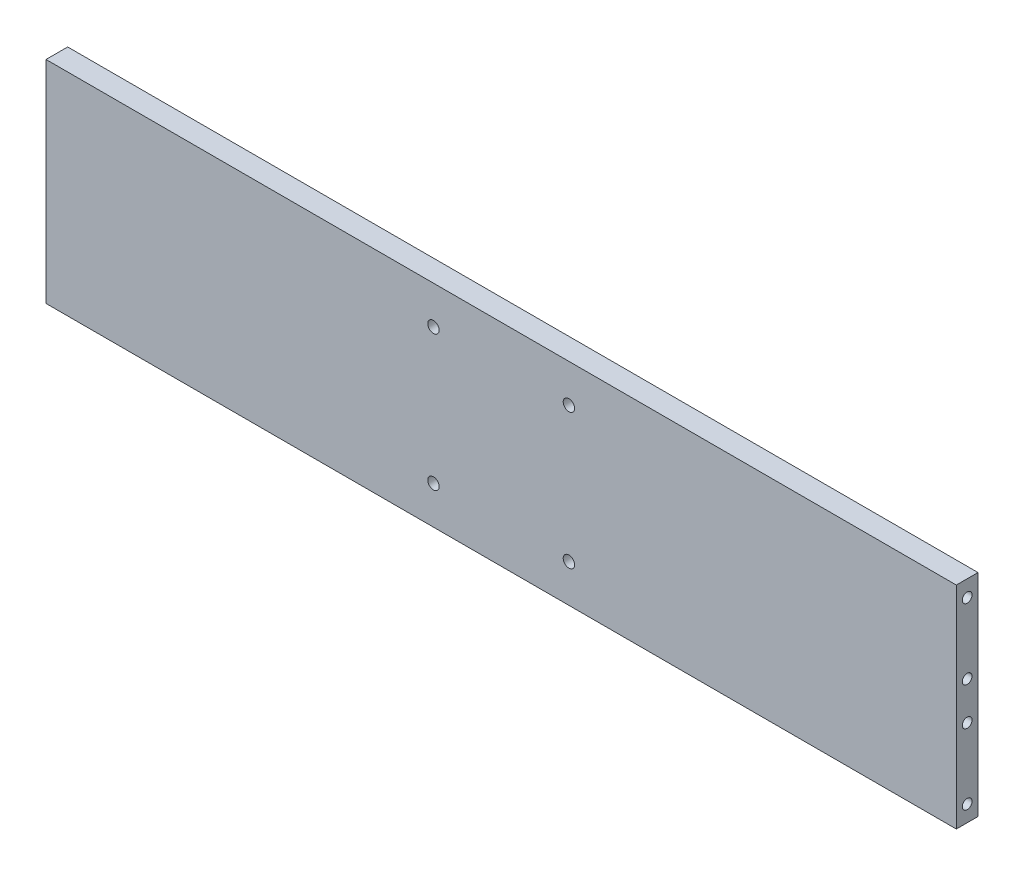
ISO-10303-21;
HEADER;
FILE_DESCRIPTION(('STEP AP214'),'2;1');
FILE_NAME('part.step','',(''),(''),'','','');
FILE_SCHEMA(('AUTOMOTIVE_DESIGN { 1 0 10303 214 1 1 1 1 }'));
ENDSEC;
DATA;
#1=APPLICATION_CONTEXT('core data for automotive mechanical design processes');
#2=APPLICATION_PROTOCOL_DEFINITION('international standard','automotive_design',2000,#1);
#3=PRODUCT_CONTEXT('',#1,'mechanical');
#4=PRODUCT('Part','Part','',(#3));
#5=PRODUCT_RELATED_PRODUCT_CATEGORY('part','',(#4));
#6=PRODUCT_DEFINITION_FORMATION('','',#4);
#7=PRODUCT_DEFINITION_CONTEXT('part definition',#1,'design');
#8=PRODUCT_DEFINITION('design','',#6,#7);
#9=PRODUCT_DEFINITION_SHAPE('','',#8);
#10=(LENGTH_UNIT() NAMED_UNIT(*) SI_UNIT(.MILLI.,.METRE.));
#11=(NAMED_UNIT(*) PLANE_ANGLE_UNIT() SI_UNIT($,.RADIAN.));
#12=(NAMED_UNIT(*) SI_UNIT($,.STERADIAN.) SOLID_ANGLE_UNIT());
#13=UNCERTAINTY_MEASURE_WITH_UNIT(LENGTH_MEASURE(1.E-05),#10,'distance_accuracy_value','');
#14=(GEOMETRIC_REPRESENTATION_CONTEXT(3) GLOBAL_UNCERTAINTY_ASSIGNED_CONTEXT((#13)) GLOBAL_UNIT_ASSIGNED_CONTEXT((#10,
#11,#12)) REPRESENTATION_CONTEXT('',''));
#15=CARTESIAN_POINT('',(0.,0.,0.));
#16=DIRECTION('',(0.,0.,1.));
#17=DIRECTION('',(1.,0.,0.));
#18=AXIS2_PLACEMENT_3D('',#15,#16,#17);
#19=CARTESIAN_POINT('',(0.,0.,8.));
#20=DIRECTION('',(0.,0.,-1.));
#21=DIRECTION('',(-1.,0.,0.));
#22=AXIS2_PLACEMENT_3D('',#19,#20,#21);
#23=PLANE('',#22);
#24=CARTESIAN_POINT('',(25.,-25.,8.));
#25=DIRECTION('',(0.,0.,1.));
#26=DIRECTION('',(1.,0.,0.));
#27=AXIS2_PLACEMENT_3D('',#24,#25,#26);
#28=CIRCLE('',#27,2.1);
#29=CARTESIAN_POINT('',(27.1,-25.,8.));
#30=VERTEX_POINT('',#29);
#31=EDGE_CURVE('E121',#30,#30,#28,.T.);
#32=ORIENTED_EDGE('',*,*,#31,.F.);
#33=EDGE_LOOP('',(#32));
#34=FACE_BOUND('',#33,.T.);
#35=CARTESIAN_POINT('',(-25.,25.,8.));
#36=DIRECTION('',(0.,0.,1.));
#37=DIRECTION('',(1.,0.,0.));
#38=AXIS2_PLACEMENT_3D('',#35,#36,#37);
#39=CIRCLE('',#38,2.1);
#40=CARTESIAN_POINT('',(-22.9,25.,8.));
#41=VERTEX_POINT('',#40);
#42=EDGE_CURVE('E100',#41,#41,#39,.T.);
#43=ORIENTED_EDGE('',*,*,#42,.F.);
#44=EDGE_LOOP('',(#43));
#45=FACE_BOUND('',#44,.T.);
#46=DIRECTION('',(0.,1.,0.));
#47=VECTOR('',#46,1.);
#48=CARTESIAN_POINT('',(168.,-39.,8.));
#49=LINE('',#48,#47);
#50=CARTESIAN_POINT('',(168.,-39.,8.));
#51=VERTEX_POINT('',#50);
#52=CARTESIAN_POINT('',(168.,39.,8.));
#53=VERTEX_POINT('',#52);
#54=EDGE_CURVE('E85',#51,#53,#49,.T.);
#55=ORIENTED_EDGE('',*,*,#54,.T.);
#56=DIRECTION('',(-1.,0.,0.));
#57=VECTOR('',#56,1.);
#58=CARTESIAN_POINT('',(-168.,39.,8.));
#59=LINE('',#58,#57);
#60=CARTESIAN_POINT('',(-168.,39.,8.));
#61=VERTEX_POINT('',#60);
#62=EDGE_CURVE('E80',#53,#61,#59,.T.);
#63=ORIENTED_EDGE('',*,*,#62,.T.);
#64=DIRECTION('',(0.,-1.,0.));
#65=VECTOR('',#64,1.);
#66=CARTESIAN_POINT('',(-168.,-39.,8.));
#67=LINE('',#66,#65);
#68=CARTESIAN_POINT('',(-168.,-39.,8.));
#69=VERTEX_POINT('',#68);
#70=EDGE_CURVE('E83',#61,#69,#67,.T.);
#71=ORIENTED_EDGE('',*,*,#70,.T.);
#72=DIRECTION('',(1.,0.,0.));
#73=VECTOR('',#72,1.);
#74=CARTESIAN_POINT('',(-168.,-39.,8.));
#75=LINE('',#74,#73);
#76=EDGE_CURVE('E50',#69,#51,#75,.T.);
#77=ORIENTED_EDGE('',*,*,#76,.T.);
#78=EDGE_LOOP('',(#55,#63,#71,#77));
#79=FACE_BOUND('',#78,.T.);
#80=CARTESIAN_POINT('',(25.,25.,8.));
#81=DIRECTION('',(0.,0.,1.));
#82=DIRECTION('',(1.,0.,0.));
#83=AXIS2_PLACEMENT_3D('',#80,#81,#82);
#84=CIRCLE('',#83,2.1);
#85=CARTESIAN_POINT('',(27.1,25.,8.));
#86=VERTEX_POINT('',#85);
#87=EDGE_CURVE('E115',#86,#86,#84,.T.);
#88=ORIENTED_EDGE('',*,*,#87,.F.);
#89=EDGE_LOOP('',(#88));
#90=FACE_BOUND('',#89,.T.);
#91=CARTESIAN_POINT('',(-25.,-25.,8.));
#92=DIRECTION('',(0.,0.,1.));
#93=DIRECTION('',(1.,0.,0.));
#94=AXIS2_PLACEMENT_3D('',#91,#92,#93);
#95=CIRCLE('',#94,2.1);
#96=CARTESIAN_POINT('',(-22.9,-25.,8.));
#97=VERTEX_POINT('',#96);
#98=EDGE_CURVE('E127',#97,#97,#95,.T.);
#99=ORIENTED_EDGE('',*,*,#98,.F.);
#100=EDGE_LOOP('',(#99));
#101=FACE_BOUND('',#100,.T.);
#102=ADVANCED_FACE('F33',(#34,#45,#79,#90,#101),#23,.F.);
#103=CARTESIAN_POINT('',(0.,0.,0.));
#104=DIRECTION('',(0.,0.,-1.));
#105=DIRECTION('',(-1.,0.,0.));
#106=AXIS2_PLACEMENT_3D('',#103,#104,#105);
#107=PLANE('',#106);
#108=CARTESIAN_POINT('',(25.,-25.,0.));
#109=DIRECTION('',(0.,0.,1.));
#110=DIRECTION('',(1.,0.,0.));
#111=AXIS2_PLACEMENT_3D('',#108,#109,#110);
#112=CIRCLE('',#111,2.1);
#113=CARTESIAN_POINT('',(27.1,-25.,0.));
#114=VERTEX_POINT('',#113);
#115=EDGE_CURVE('E124',#114,#114,#112,.T.);
#116=ORIENTED_EDGE('',*,*,#115,.T.);
#117=EDGE_LOOP('',(#116));
#118=FACE_BOUND('',#117,.T.);
#119=CARTESIAN_POINT('',(-25.,25.,0.));
#120=DIRECTION('',(0.,0.,1.));
#121=DIRECTION('',(1.,0.,0.));
#122=AXIS2_PLACEMENT_3D('',#119,#120,#121);
#123=CIRCLE('',#122,2.1);
#124=CARTESIAN_POINT('',(-22.9,25.,0.));
#125=VERTEX_POINT('',#124);
#126=EDGE_CURVE('E112',#125,#125,#123,.T.);
#127=ORIENTED_EDGE('',*,*,#126,.T.);
#128=EDGE_LOOP('',(#127));
#129=FACE_BOUND('',#128,.T.);
#130=DIRECTION('',(0.,1.,0.));
#131=VECTOR('',#130,1.);
#132=CARTESIAN_POINT('',(168.,-39.,0.));
#133=LINE('',#132,#131);
#134=CARTESIAN_POINT('',(168.,-39.,0.));
#135=VERTEX_POINT('',#134);
#136=CARTESIAN_POINT('',(168.,39.,0.));
#137=VERTEX_POINT('',#136);
#138=EDGE_CURVE('E97',#135,#137,#133,.T.);
#139=ORIENTED_EDGE('',*,*,#138,.F.);
#140=DIRECTION('',(1.,0.,0.));
#141=VECTOR('',#140,1.);
#142=CARTESIAN_POINT('',(-168.,-39.,0.));
#143=LINE('',#142,#141);
#144=CARTESIAN_POINT('',(-168.,-39.,0.));
#145=VERTEX_POINT('',#144);
#146=EDGE_CURVE('E73',#145,#135,#143,.T.);
#147=ORIENTED_EDGE('',*,*,#146,.F.);
#148=DIRECTION('',(0.,-1.,0.));
#149=VECTOR('',#148,1.);
#150=CARTESIAN_POINT('',(-168.,-39.,0.));
#151=LINE('',#150,#149);
#152=CARTESIAN_POINT('',(-168.,39.,0.));
#153=VERTEX_POINT('',#152);
#154=EDGE_CURVE('E67',#153,#145,#151,.T.);
#155=ORIENTED_EDGE('',*,*,#154,.F.);
#156=DIRECTION('',(-1.,0.,0.));
#157=VECTOR('',#156,1.);
#158=CARTESIAN_POINT('',(-168.,39.,0.));
#159=LINE('',#158,#157);
#160=EDGE_CURVE('E89',#137,#153,#159,.T.);
#161=ORIENTED_EDGE('',*,*,#160,.F.);
#162=EDGE_LOOP('',(#139,#147,#155,#161));
#163=FACE_BOUND('',#162,.T.);
#164=CARTESIAN_POINT('',(25.,25.,0.));
#165=DIRECTION('',(0.,0.,1.));
#166=DIRECTION('',(1.,0.,0.));
#167=AXIS2_PLACEMENT_3D('',#164,#165,#166);
#168=CIRCLE('',#167,2.1);
#169=CARTESIAN_POINT('',(27.1,25.,0.));
#170=VERTEX_POINT('',#169);
#171=EDGE_CURVE('E118',#170,#170,#168,.T.);
#172=ORIENTED_EDGE('',*,*,#171,.T.);
#173=EDGE_LOOP('',(#172));
#174=FACE_BOUND('',#173,.T.);
#175=CARTESIAN_POINT('',(-25.,-25.,0.));
#176=DIRECTION('',(0.,0.,1.));
#177=DIRECTION('',(1.,0.,0.));
#178=AXIS2_PLACEMENT_3D('',#175,#176,#177);
#179=CIRCLE('',#178,2.1);
#180=CARTESIAN_POINT('',(-22.9,-25.,0.));
#181=VERTEX_POINT('',#180);
#182=EDGE_CURVE('E130',#181,#181,#179,.T.);
#183=ORIENTED_EDGE('',*,*,#182,.T.);
#184=EDGE_LOOP('',(#183));
#185=FACE_BOUND('',#184,.T.);
#186=ADVANCED_FACE('F108',(#118,#129,#163,#174,#185),#107,.T.);
#187=CARTESIAN_POINT('',(168.,-39.,8.));
#188=DIRECTION('',(-1.,0.,0.));
#189=DIRECTION('',(0.,0.,1.));
#190=AXIS2_PLACEMENT_3D('',#187,#188,#189);
#191=PLANE('',#190);
#192=CARTESIAN_POINT('',(168.,-33.,4.));
#193=DIRECTION('',(1.,0.,0.));
#194=DIRECTION('',(0.,0.,1.));
#195=AXIS2_PLACEMENT_3D('',#192,#193,#194);
#196=CIRCLE('',#195,1.8);
#197=CARTESIAN_POINT('',(168.,-33.,5.80000000000001));
#198=VERTEX_POINT('',#197);
#199=EDGE_CURVE('E156',#198,#198,#196,.T.);
#200=ORIENTED_EDGE('',*,*,#199,.F.);
#201=EDGE_LOOP('',(#200));
#202=FACE_BOUND('',#201,.T.);
#203=CARTESIAN_POINT('',(168.,-7.,3.99999999999999));
#204=DIRECTION('',(1.,0.,0.));
#205=DIRECTION('',(0.,0.,1.));
#206=AXIS2_PLACEMENT_3D('',#203,#204,#205);
#207=CIRCLE('',#206,1.8);
#208=CARTESIAN_POINT('',(168.,-7.,5.79999999999999));
#209=VERTEX_POINT('',#208);
#210=EDGE_CURVE('E150',#209,#209,#207,.T.);
#211=ORIENTED_EDGE('',*,*,#210,.F.);
#212=EDGE_LOOP('',(#211));
#213=FACE_BOUND('',#212,.T.);
#214=CARTESIAN_POINT('',(168.,7.,3.99999999999999));
#215=DIRECTION('',(1.,0.,0.));
#216=DIRECTION('',(0.,0.,-1.));
#217=AXIS2_PLACEMENT_3D('',#214,#215,#216);
#218=CIRCLE('',#217,1.8);
#219=CARTESIAN_POINT('',(168.,7.,2.2));
#220=VERTEX_POINT('',#219);
#221=EDGE_CURVE('E144',#220,#220,#218,.T.);
#222=ORIENTED_EDGE('',*,*,#221,.F.);
#223=EDGE_LOOP('',(#222));
#224=FACE_BOUND('',#223,.T.);
#225=CARTESIAN_POINT('',(168.,33.,4.));
#226=DIRECTION('',(1.,0.,0.));
#227=DIRECTION('',(0.,0.,-1.));
#228=AXIS2_PLACEMENT_3D('',#225,#226,#227);
#229=CIRCLE('',#228,1.8);
#230=CARTESIAN_POINT('',(168.,33.,2.2));
#231=VERTEX_POINT('',#230);
#232=EDGE_CURVE('E138',#231,#231,#229,.T.);
#233=ORIENTED_EDGE('',*,*,#232,.F.);
#234=EDGE_LOOP('',(#233));
#235=FACE_BOUND('',#234,.T.);
#236=ORIENTED_EDGE('',*,*,#138,.T.);
#237=DIRECTION('',(0.,0.,-1.));
#238=VECTOR('',#237,1.);
#239=CARTESIAN_POINT('',(168.,39.,8.));
#240=LINE('',#239,#238);
#241=EDGE_CURVE('E11',#53,#137,#240,.T.);
#242=ORIENTED_EDGE('',*,*,#241,.F.);
#243=ORIENTED_EDGE('',*,*,#54,.F.);
#244=DIRECTION('',(0.,0.,-1.));
#245=VECTOR('',#244,1.);
#246=CARTESIAN_POINT('',(168.,-39.,8.));
#247=LINE('',#246,#245);
#248=EDGE_CURVE('E93',#51,#135,#247,.T.);
#249=ORIENTED_EDGE('',*,*,#248,.T.);
#250=EDGE_LOOP('',(#236,#242,#243,#249));
#251=FACE_BOUND('',#250,.T.);
#252=ADVANCED_FACE('F35',(#202,#213,#224,#235,#251),#191,.F.);
#253=CARTESIAN_POINT('',(-168.,39.,8.));
#254=DIRECTION('',(0.,-1.,0.));
#255=DIRECTION('',(0.,0.,-1.));
#256=AXIS2_PLACEMENT_3D('',#253,#254,#255);
#257=PLANE('',#256);
#258=ORIENTED_EDGE('',*,*,#160,.T.);
#259=DIRECTION('',(0.,0.,-1.));
#260=VECTOR('',#259,1.);
#261=CARTESIAN_POINT('',(-168.,39.,8.));
#262=LINE('',#261,#260);
#263=EDGE_CURVE('E42',#61,#153,#262,.T.);
#264=ORIENTED_EDGE('',*,*,#263,.F.);
#265=ORIENTED_EDGE('',*,*,#62,.F.);
#266=ORIENTED_EDGE('',*,*,#241,.T.);
#267=EDGE_LOOP('',(#258,#264,#265,#266));
#268=FACE_BOUND('',#267,.T.);
#269=ADVANCED_FACE('F88',(#268),#257,.F.);
#270=CARTESIAN_POINT('',(-168.,-39.,8.));
#271=DIRECTION('',(1.,0.,0.));
#272=DIRECTION('',(0.,0.,-1.));
#273=AXIS2_PLACEMENT_3D('',#270,#271,#272);
#274=PLANE('',#273);
#275=CARTESIAN_POINT('',(-168.,-33.,4.));
#276=DIRECTION('',(1.,0.,0.));
#277=DIRECTION('',(0.,0.,-1.));
#278=AXIS2_PLACEMENT_3D('',#275,#276,#277);
#279=CIRCLE('',#278,1.8);
#280=CARTESIAN_POINT('',(-168.,-33.,2.2));
#281=VERTEX_POINT('',#280);
#282=EDGE_CURVE('E153',#281,#281,#279,.F.);
#283=ORIENTED_EDGE('',*,*,#282,.F.);
#284=EDGE_LOOP('',(#283));
#285=FACE_BOUND('',#284,.T.);
#286=CARTESIAN_POINT('',(-168.,-7.,3.99999999999999));
#287=DIRECTION('',(1.,0.,0.));
#288=DIRECTION('',(0.,0.,-1.));
#289=AXIS2_PLACEMENT_3D('',#286,#287,#288);
#290=CIRCLE('',#289,1.8);
#291=CARTESIAN_POINT('',(-168.,-7.,2.2));
#292=VERTEX_POINT('',#291);
#293=EDGE_CURVE('E147',#292,#292,#290,.F.);
#294=ORIENTED_EDGE('',*,*,#293,.F.);
#295=EDGE_LOOP('',(#294));
#296=FACE_BOUND('',#295,.T.);
#297=CARTESIAN_POINT('',(-168.,7.,3.99999999999999));
#298=DIRECTION('',(1.,0.,0.));
#299=DIRECTION('',(0.,0.,-1.));
#300=AXIS2_PLACEMENT_3D('',#297,#298,#299);
#301=CIRCLE('',#300,1.8);
#302=CARTESIAN_POINT('',(-168.,7.,2.2));
#303=VERTEX_POINT('',#302);
#304=EDGE_CURVE('E141',#303,#303,#301,.F.);
#305=ORIENTED_EDGE('',*,*,#304,.F.);
#306=EDGE_LOOP('',(#305));
#307=FACE_BOUND('',#306,.T.);
#308=CARTESIAN_POINT('',(-168.,33.,4.));
#309=DIRECTION('',(1.,0.,0.));
#310=DIRECTION('',(0.,0.,-1.));
#311=AXIS2_PLACEMENT_3D('',#308,#309,#310);
#312=CIRCLE('',#311,1.8);
#313=CARTESIAN_POINT('',(-168.,33.,2.2));
#314=VERTEX_POINT('',#313);
#315=EDGE_CURVE('E133',#314,#314,#312,.F.);
#316=ORIENTED_EDGE('',*,*,#315,.F.);
#317=EDGE_LOOP('',(#316));
#318=FACE_BOUND('',#317,.T.);
#319=ORIENTED_EDGE('',*,*,#154,.T.);
#320=DIRECTION('',(0.,0.,-1.));
#321=VECTOR('',#320,1.);
#322=CARTESIAN_POINT('',(-168.,-39.,8.));
#323=LINE('',#322,#321);
#324=EDGE_CURVE('E90',#69,#145,#323,.T.);
#325=ORIENTED_EDGE('',*,*,#324,.F.);
#326=ORIENTED_EDGE('',*,*,#70,.F.);
#327=ORIENTED_EDGE('',*,*,#263,.T.);
#328=EDGE_LOOP('',(#319,#325,#326,#327));
#329=FACE_BOUND('',#328,.T.);
#330=ADVANCED_FACE('F91',(#285,#296,#307,#318,#329),#274,.F.);
#331=CARTESIAN_POINT('',(-168.,-39.,8.));
#332=DIRECTION('',(0.,1.,0.));
#333=DIRECTION('',(0.,0.,1.));
#334=AXIS2_PLACEMENT_3D('',#331,#332,#333);
#335=PLANE('',#334);
#336=ORIENTED_EDGE('',*,*,#146,.T.);
#337=ORIENTED_EDGE('',*,*,#248,.F.);
#338=ORIENTED_EDGE('',*,*,#76,.F.);
#339=ORIENTED_EDGE('',*,*,#324,.T.);
#340=EDGE_LOOP('',(#336,#337,#338,#339));
#341=FACE_BOUND('',#340,.T.);
#342=ADVANCED_FACE('F105',(#341),#335,.F.);
#343=CARTESIAN_POINT('',(-25.,25.,8.));
#344=DIRECTION('',(0.,0.,-1.));
#345=DIRECTION('',(-1.,0.,0.));
#346=AXIS2_PLACEMENT_3D('',#343,#344,#345);
#347=CYLINDRICAL_SURFACE('',#346,2.1);
#348=ORIENTED_EDGE('',*,*,#42,.T.);
#349=EDGE_LOOP('',(#348));
#350=FACE_BOUND('',#349,.T.);
#351=ORIENTED_EDGE('',*,*,#126,.F.);
#352=EDGE_LOOP('',(#351));
#353=FACE_BOUND('',#352,.T.);
#354=ADVANCED_FACE('F186',(#350,#353),#347,.F.);
#355=CARTESIAN_POINT('',(25.,25.,8.));
#356=DIRECTION('',(0.,0.,-1.));
#357=DIRECTION('',(-1.,0.,0.));
#358=AXIS2_PLACEMENT_3D('',#355,#356,#357);
#359=CYLINDRICAL_SURFACE('',#358,2.1);
#360=ORIENTED_EDGE('',*,*,#87,.T.);
#361=EDGE_LOOP('',(#360));
#362=FACE_BOUND('',#361,.T.);
#363=ORIENTED_EDGE('',*,*,#171,.F.);
#364=EDGE_LOOP('',(#363));
#365=FACE_BOUND('',#364,.T.);
#366=ADVANCED_FACE('F203',(#362,#365),#359,.F.);
#367=CARTESIAN_POINT('',(25.,-25.,8.));
#368=DIRECTION('',(0.,0.,-1.));
#369=DIRECTION('',(-1.,0.,0.));
#370=AXIS2_PLACEMENT_3D('',#367,#368,#369);
#371=CYLINDRICAL_SURFACE('',#370,2.1);
#372=ORIENTED_EDGE('',*,*,#31,.T.);
#373=EDGE_LOOP('',(#372));
#374=FACE_BOUND('',#373,.T.);
#375=ORIENTED_EDGE('',*,*,#115,.F.);
#376=EDGE_LOOP('',(#375));
#377=FACE_BOUND('',#376,.T.);
#378=ADVANCED_FACE('F207',(#374,#377),#371,.F.);
#379=CARTESIAN_POINT('',(-25.,-25.,8.));
#380=DIRECTION('',(0.,0.,-1.));
#381=DIRECTION('',(-1.,0.,0.));
#382=AXIS2_PLACEMENT_3D('',#379,#380,#381);
#383=CYLINDRICAL_SURFACE('',#382,2.1);
#384=ORIENTED_EDGE('',*,*,#98,.T.);
#385=EDGE_LOOP('',(#384));
#386=FACE_BOUND('',#385,.T.);
#387=ORIENTED_EDGE('',*,*,#182,.F.);
#388=EDGE_LOOP('',(#387));
#389=FACE_BOUND('',#388,.T.);
#390=ADVANCED_FACE('F175',(#386,#389),#383,.F.);
#391=CARTESIAN_POINT('',(-168.001,33.,4.));
#392=DIRECTION('',(1.,0.,0.));
#393=DIRECTION('',(0.,0.,-1.));
#394=AXIS2_PLACEMENT_3D('',#391,#392,#393);
#395=CYLINDRICAL_SURFACE('',#394,1.8);
#396=ORIENTED_EDGE('',*,*,#232,.T.);
#397=EDGE_LOOP('',(#396));
#398=FACE_BOUND('',#397,.T.);
#399=ORIENTED_EDGE('',*,*,#315,.T.);
#400=EDGE_LOOP('',(#399));
#401=FACE_BOUND('',#400,.T.);
#402=ADVANCED_FACE('F171',(#398,#401),#395,.F.);
#403=CARTESIAN_POINT('',(-168.001,7.,3.99999999999999));
#404=DIRECTION('',(1.,0.,0.));
#405=DIRECTION('',(0.,0.,-1.));
#406=AXIS2_PLACEMENT_3D('',#403,#404,#405);
#407=CYLINDRICAL_SURFACE('',#406,1.8);
#408=ORIENTED_EDGE('',*,*,#221,.T.);
#409=EDGE_LOOP('',(#408));
#410=FACE_BOUND('',#409,.T.);
#411=ORIENTED_EDGE('',*,*,#304,.T.);
#412=EDGE_LOOP('',(#411));
#413=FACE_BOUND('',#412,.T.);
#414=ADVANCED_FACE('F174',(#410,#413),#407,.F.);
#415=CARTESIAN_POINT('',(-168.001,-7.,3.99999999999999));
#416=DIRECTION('',(1.,0.,0.));
#417=DIRECTION('',(0.,0.,-1.));
#418=AXIS2_PLACEMENT_3D('',#415,#416,#417);
#419=CYLINDRICAL_SURFACE('',#418,1.8);
#420=ORIENTED_EDGE('',*,*,#210,.T.);
#421=EDGE_LOOP('',(#420));
#422=FACE_BOUND('',#421,.T.);
#423=ORIENTED_EDGE('',*,*,#293,.T.);
#424=EDGE_LOOP('',(#423));
#425=FACE_BOUND('',#424,.T.);
#426=ADVANCED_FACE('F217',(#422,#425),#419,.F.);
#427=CARTESIAN_POINT('',(-168.001,-33.,4.));
#428=DIRECTION('',(1.,0.,0.));
#429=DIRECTION('',(0.,0.,-1.));
#430=AXIS2_PLACEMENT_3D('',#427,#428,#429);
#431=CYLINDRICAL_SURFACE('',#430,1.8);
#432=ORIENTED_EDGE('',*,*,#199,.T.);
#433=EDGE_LOOP('',(#432));
#434=FACE_BOUND('',#433,.T.);
#435=ORIENTED_EDGE('',*,*,#282,.T.);
#436=EDGE_LOOP('',(#435));
#437=FACE_BOUND('',#436,.T.);
#438=ADVANCED_FACE('F160',(#434,#437),#431,.F.);
#439=CLOSED_SHELL('',(#102,#186,#252,#269,#330,#342,#354,#366,#378,#390,#402,#414,#426,#438));
#440=MANIFOLD_SOLID_BREP('B2',#439);
#441=ADVANCED_BREP_SHAPE_REPRESENTATION('',(#18,#440),#14);
#442=SHAPE_DEFINITION_REPRESENTATION(#9,#441);
ENDSEC;
END-ISO-10303-21;
